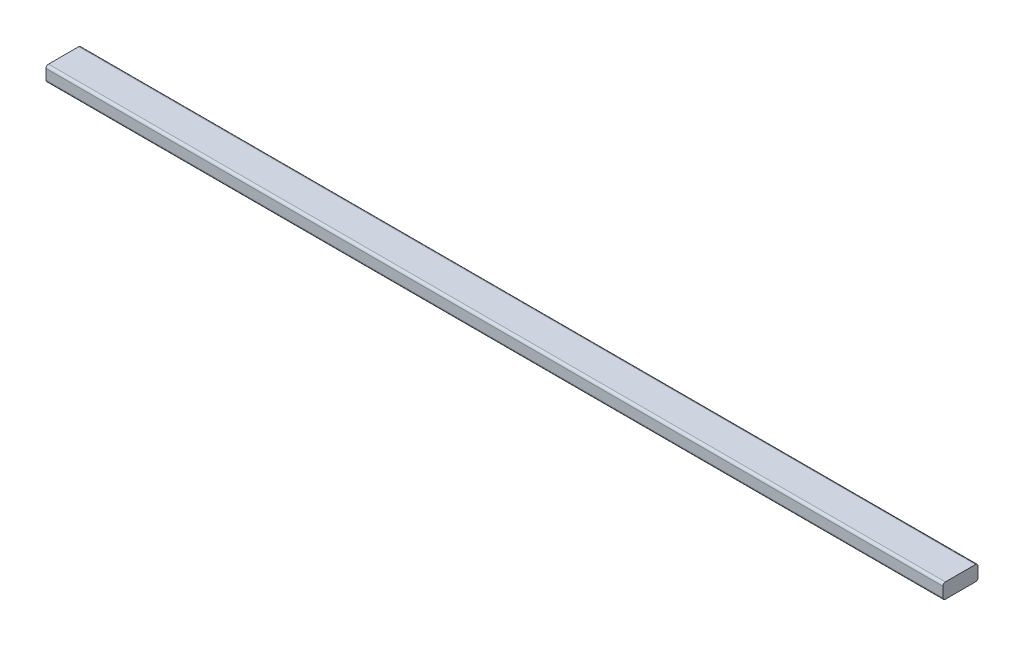
ISO-10303-21;
HEADER;
FILE_DESCRIPTION(('STEP AP214'),'2;1');
FILE_NAME('part.step','',(''),(''),'','','');
FILE_SCHEMA(('AUTOMOTIVE_DESIGN { 1 0 10303 214 1 1 1 1 }'));
ENDSEC;
DATA;
#1=APPLICATION_CONTEXT('core data for automotive mechanical design processes');
#2=APPLICATION_PROTOCOL_DEFINITION('international standard','automotive_design',2000,#1);
#3=PRODUCT_CONTEXT('',#1,'mechanical');
#4=PRODUCT('Part','Part','',(#3));
#5=PRODUCT_RELATED_PRODUCT_CATEGORY('part','',(#4));
#6=PRODUCT_DEFINITION_FORMATION('','',#4);
#7=PRODUCT_DEFINITION_CONTEXT('part definition',#1,'design');
#8=PRODUCT_DEFINITION('design','',#6,#7);
#9=PRODUCT_DEFINITION_SHAPE('','',#8);
#10=(LENGTH_UNIT() NAMED_UNIT(*) SI_UNIT(.MILLI.,.METRE.));
#11=(NAMED_UNIT(*) PLANE_ANGLE_UNIT() SI_UNIT($,.RADIAN.));
#12=(NAMED_UNIT(*) SI_UNIT($,.STERADIAN.) SOLID_ANGLE_UNIT());
#13=UNCERTAINTY_MEASURE_WITH_UNIT(LENGTH_MEASURE(1.E-05),#10,'distance_accuracy_value','');
#14=(GEOMETRIC_REPRESENTATION_CONTEXT(3) GLOBAL_UNCERTAINTY_ASSIGNED_CONTEXT((#13)) GLOBAL_UNIT_ASSIGNED_CONTEXT((#10,
#11,#12)) REPRESENTATION_CONTEXT('',''));
#15=CARTESIAN_POINT('',(0.,0.,0.));
#16=DIRECTION('',(0.,0.,1.));
#17=DIRECTION('',(1.,0.,0.));
#18=AXIS2_PLACEMENT_3D('',#15,#16,#17);
#19=CARTESIAN_POINT('',(1134.11,-12.7,38.1));
#20=DIRECTION('',(-1.,0.,0.));
#21=DIRECTION('',(0.,0.,1.));
#22=AXIS2_PLACEMENT_3D('',#19,#20,#21);
#23=CYLINDRICAL_SURFACE('',#22,6.35);
#24=CARTESIAN_POINT('',(-1134.11,-12.7,38.1));
#25=DIRECTION('',(1.,0.,0.));
#26=DIRECTION('',(0.,0.,1.));
#27=AXIS2_PLACEMENT_3D('',#24,#25,#26);
#28=CIRCLE('',#27,6.35);
#29=CARTESIAN_POINT('',(-1134.11,-12.7,44.45));
#30=VERTEX_POINT('',#29);
#31=CARTESIAN_POINT('',(-1134.11,-19.05,38.0999999999999));
#32=VERTEX_POINT('',#31);
#33=EDGE_CURVE('E130',#30,#32,#28,.T.);
#34=ORIENTED_EDGE('',*,*,#33,.T.);
#35=DIRECTION('',(-1.,0.,0.));
#36=VECTOR('',#35,1.);
#37=CARTESIAN_POINT('',(1134.11,-19.05,38.0999999999999));
#38=LINE('',#37,#36);
#39=CARTESIAN_POINT('',(1134.11,-19.05,38.0999999999999));
#40=VERTEX_POINT('',#39);
#41=EDGE_CURVE('E11',#40,#32,#38,.T.);
#42=ORIENTED_EDGE('',*,*,#41,.F.);
#43=CARTESIAN_POINT('',(1134.11,-12.7,38.1));
#44=DIRECTION('',(1.,0.,0.));
#45=DIRECTION('',(0.,0.,1.));
#46=AXIS2_PLACEMENT_3D('',#43,#44,#45);
#47=CIRCLE('',#46,6.35);
#48=CARTESIAN_POINT('',(1134.11,-12.7,44.45));
#49=VERTEX_POINT('',#48);
#50=EDGE_CURVE('E144',#49,#40,#47,.T.);
#51=ORIENTED_EDGE('',*,*,#50,.F.);
#52=DIRECTION('',(-1.,0.,0.));
#53=VECTOR('',#52,1.);
#54=CARTESIAN_POINT('',(1134.11,-12.7,44.45));
#55=LINE('',#54,#53);
#56=EDGE_CURVE('E126',#49,#30,#55,.T.);
#57=ORIENTED_EDGE('',*,*,#56,.T.);
#58=EDGE_LOOP('',(#34,#42,#51,#57));
#59=FACE_BOUND('',#58,.T.);
#60=ADVANCED_FACE('F34',(#59),#23,.T.);
#61=CARTESIAN_POINT('',(1134.11,-19.05,38.0999999999999));
#62=DIRECTION('',(0.,1.,0.));
#63=DIRECTION('',(0.,0.,1.));
#64=AXIS2_PLACEMENT_3D('',#61,#62,#63);
#65=PLANE('',#64);
#66=DIRECTION('',(0.,0.,-1.));
#67=VECTOR('',#66,1.);
#68=CARTESIAN_POINT('',(-1134.11,-19.05,38.0999999999999));
#69=LINE('',#68,#67);
#70=CARTESIAN_POINT('',(-1134.11,-19.05,-38.0999999999999));
#71=VERTEX_POINT('',#70);
#72=EDGE_CURVE('E133',#32,#71,#69,.T.);
#73=ORIENTED_EDGE('',*,*,#72,.T.);
#74=DIRECTION('',(-1.,0.,0.));
#75=VECTOR('',#74,1.);
#76=CARTESIAN_POINT('',(1134.11,-19.05,-38.0999999999999));
#77=LINE('',#76,#75);
#78=CARTESIAN_POINT('',(1134.11,-19.05,-38.0999999999999));
#79=VERTEX_POINT('',#78);
#80=EDGE_CURVE('E42',#79,#71,#77,.T.);
#81=ORIENTED_EDGE('',*,*,#80,.F.);
#82=DIRECTION('',(0.,0.,-1.));
#83=VECTOR('',#82,1.);
#84=CARTESIAN_POINT('',(1134.11,-19.05,38.0999999999999));
#85=LINE('',#84,#83);
#86=EDGE_CURVE('E93',#40,#79,#85,.T.);
#87=ORIENTED_EDGE('',*,*,#86,.F.);
#88=ORIENTED_EDGE('',*,*,#41,.T.);
#89=EDGE_LOOP('',(#73,#81,#87,#88));
#90=FACE_BOUND('',#89,.T.);
#91=ADVANCED_FACE('F179',(#90),#65,.F.);
#92=CARTESIAN_POINT('',(1134.11,-12.7,-38.1));
#93=DIRECTION('',(-1.,0.,0.));
#94=DIRECTION('',(0.,0.,1.));
#95=AXIS2_PLACEMENT_3D('',#92,#93,#94);
#96=CYLINDRICAL_SURFACE('',#95,6.35);
#97=CARTESIAN_POINT('',(-1134.11,-12.7,-38.1));
#98=DIRECTION('',(1.,0.,0.));
#99=DIRECTION('',(0.,0.,-1.));
#100=AXIS2_PLACEMENT_3D('',#97,#98,#99);
#101=CIRCLE('',#100,6.35);
#102=CARTESIAN_POINT('',(-1134.11,-12.7,-44.45));
#103=VERTEX_POINT('',#102);
#104=EDGE_CURVE('E135',#71,#103,#101,.T.);
#105=ORIENTED_EDGE('',*,*,#104,.T.);
#106=DIRECTION('',(-1.,0.,0.));
#107=VECTOR('',#106,1.);
#108=CARTESIAN_POINT('',(1134.11,-12.7,-44.45));
#109=LINE('',#108,#107);
#110=CARTESIAN_POINT('',(1134.11,-12.7,-44.45));
#111=VERTEX_POINT('',#110);
#112=EDGE_CURVE('E151',#111,#103,#109,.T.);
#113=ORIENTED_EDGE('',*,*,#112,.F.);
#114=CARTESIAN_POINT('',(1134.11,-12.7,-38.1));
#115=DIRECTION('',(1.,0.,0.));
#116=DIRECTION('',(0.,0.,-1.));
#117=AXIS2_PLACEMENT_3D('',#114,#115,#116);
#118=CIRCLE('',#117,6.35);
#119=EDGE_CURVE('E159',#79,#111,#118,.T.);
#120=ORIENTED_EDGE('',*,*,#119,.F.);
#121=ORIENTED_EDGE('',*,*,#80,.T.);
#122=EDGE_LOOP('',(#105,#113,#120,#121));
#123=FACE_BOUND('',#122,.T.);
#124=ADVANCED_FACE('F157',(#123),#96,.T.);
#125=CARTESIAN_POINT('',(1134.11,-12.7,-44.45));
#126=DIRECTION('',(0.,0.,1.));
#127=DIRECTION('',(1.,0.,0.));
#128=AXIS2_PLACEMENT_3D('',#125,#126,#127);
#129=PLANE('',#128);
#130=DIRECTION('',(0.,1.,0.));
#131=VECTOR('',#130,1.);
#132=CARTESIAN_POINT('',(-1134.11,-12.7,-44.45));
#133=LINE('',#132,#131);
#134=CARTESIAN_POINT('',(-1134.11,12.7,-44.45));
#135=VERTEX_POINT('',#134);
#136=EDGE_CURVE('E137',#103,#135,#133,.T.);
#137=ORIENTED_EDGE('',*,*,#136,.T.);
#138=DIRECTION('',(-1.,0.,0.));
#139=VECTOR('',#138,1.);
#140=CARTESIAN_POINT('',(1134.11,12.7,-44.45));
#141=LINE('',#140,#139);
#142=CARTESIAN_POINT('',(1134.11,12.7,-44.45));
#143=VERTEX_POINT('',#142);
#144=EDGE_CURVE('E148',#143,#135,#141,.T.);
#145=ORIENTED_EDGE('',*,*,#144,.F.);
#146=DIRECTION('',(0.,1.,0.));
#147=VECTOR('',#146,1.);
#148=CARTESIAN_POINT('',(1134.11,-12.7,-44.45));
#149=LINE('',#148,#147);
#150=EDGE_CURVE('E171',#111,#143,#149,.T.);
#151=ORIENTED_EDGE('',*,*,#150,.F.);
#152=ORIENTED_EDGE('',*,*,#112,.T.);
#153=EDGE_LOOP('',(#137,#145,#151,#152));
#154=FACE_BOUND('',#153,.T.);
#155=ADVANCED_FACE('F167',(#154),#129,.F.);
#156=CARTESIAN_POINT('',(1134.11,12.7,-38.1));
#157=DIRECTION('',(-1.,0.,0.));
#158=DIRECTION('',(0.,0.,1.));
#159=AXIS2_PLACEMENT_3D('',#156,#157,#158);
#160=CYLINDRICAL_SURFACE('',#159,6.35);
#161=CARTESIAN_POINT('',(-1134.11,12.7,-38.1));
#162=DIRECTION('',(1.,0.,0.));
#163=DIRECTION('',(0.,0.,1.));
#164=AXIS2_PLACEMENT_3D('',#161,#162,#163);
#165=CIRCLE('',#164,6.35);
#166=CARTESIAN_POINT('',(-1134.11,19.05,-38.0999999999999));
#167=VERTEX_POINT('',#166);
#168=EDGE_CURVE('E139',#135,#167,#165,.T.);
#169=ORIENTED_EDGE('',*,*,#168,.T.);
#170=DIRECTION('',(-1.,0.,0.));
#171=VECTOR('',#170,1.);
#172=CARTESIAN_POINT('',(1134.11,19.05,-38.0999999999999));
#173=LINE('',#172,#171);
#174=CARTESIAN_POINT('',(1134.11,19.05,-38.0999999999999));
#175=VERTEX_POINT('',#174);
#176=EDGE_CURVE('E121',#175,#167,#173,.T.);
#177=ORIENTED_EDGE('',*,*,#176,.F.);
#178=CARTESIAN_POINT('',(1134.11,12.7,-38.1));
#179=DIRECTION('',(1.,0.,0.));
#180=DIRECTION('',(0.,0.,1.));
#181=AXIS2_PLACEMENT_3D('',#178,#179,#180);
#182=CIRCLE('',#181,6.35);
#183=EDGE_CURVE('E112',#143,#175,#182,.T.);
#184=ORIENTED_EDGE('',*,*,#183,.F.);
#185=ORIENTED_EDGE('',*,*,#144,.T.);
#186=EDGE_LOOP('',(#169,#177,#184,#185));
#187=FACE_BOUND('',#186,.T.);
#188=ADVANCED_FACE('F170',(#187),#160,.T.);
#189=CARTESIAN_POINT('',(1134.11,19.05,38.0999999999999));
#190=DIRECTION('',(0.,-1.,0.));
#191=DIRECTION('',(0.,0.,-1.));
#192=AXIS2_PLACEMENT_3D('',#189,#190,#191);
#193=PLANE('',#192);
#194=DIRECTION('',(0.,0.,1.));
#195=VECTOR('',#194,1.);
#196=CARTESIAN_POINT('',(-1134.11,19.05,38.0999999999999));
#197=LINE('',#196,#195);
#198=CARTESIAN_POINT('',(-1134.11,19.05,38.0999999999999));
#199=VERTEX_POINT('',#198);
#200=EDGE_CURVE('E120',#167,#199,#197,.T.);
#201=ORIENTED_EDGE('',*,*,#200,.T.);
#202=DIRECTION('',(-1.,0.,0.));
#203=VECTOR('',#202,1.);
#204=CARTESIAN_POINT('',(1134.11,19.05,38.0999999999999));
#205=LINE('',#204,#203);
#206=CARTESIAN_POINT('',(1134.11,19.05,38.0999999999999));
#207=VERTEX_POINT('',#206);
#208=EDGE_CURVE('E117',#207,#199,#205,.T.);
#209=ORIENTED_EDGE('',*,*,#208,.F.);
#210=DIRECTION('',(0.,0.,1.));
#211=VECTOR('',#210,1.);
#212=CARTESIAN_POINT('',(1134.11,19.05,38.0999999999999));
#213=LINE('',#212,#211);
#214=EDGE_CURVE('E106',#175,#207,#213,.T.);
#215=ORIENTED_EDGE('',*,*,#214,.F.);
#216=ORIENTED_EDGE('',*,*,#176,.T.);
#217=EDGE_LOOP('',(#201,#209,#215,#216));
#218=FACE_BOUND('',#217,.T.);
#219=ADVANCED_FACE('F118',(#218),#193,.F.);
#220=CARTESIAN_POINT('',(1134.11,12.7,38.1));
#221=DIRECTION('',(-1.,0.,0.));
#222=DIRECTION('',(0.,0.,1.));
#223=AXIS2_PLACEMENT_3D('',#220,#221,#222);
#224=CYLINDRICAL_SURFACE('',#223,6.35);
#225=CARTESIAN_POINT('',(-1134.11,12.7,38.1));
#226=DIRECTION('',(1.,0.,0.));
#227=DIRECTION('',(0.,0.,1.));
#228=AXIS2_PLACEMENT_3D('',#225,#226,#227);
#229=CIRCLE('',#228,6.35);
#230=CARTESIAN_POINT('',(-1134.11,12.7,44.45));
#231=VERTEX_POINT('',#230);
#232=EDGE_CURVE('E79',#199,#231,#229,.T.);
#233=ORIENTED_EDGE('',*,*,#232,.T.);
#234=DIRECTION('',(-1.,0.,0.));
#235=VECTOR('',#234,1.);
#236=CARTESIAN_POINT('',(1134.11,12.7,44.45));
#237=LINE('',#236,#235);
#238=CARTESIAN_POINT('',(1134.11,12.7,44.45));
#239=VERTEX_POINT('',#238);
#240=EDGE_CURVE('E122',#239,#231,#237,.T.);
#241=ORIENTED_EDGE('',*,*,#240,.F.);
#242=CARTESIAN_POINT('',(1134.11,12.7,38.1));
#243=DIRECTION('',(1.,0.,0.));
#244=DIRECTION('',(0.,0.,1.));
#245=AXIS2_PLACEMENT_3D('',#242,#243,#244);
#246=CIRCLE('',#245,6.35);
#247=EDGE_CURVE('E110',#207,#239,#246,.T.);
#248=ORIENTED_EDGE('',*,*,#247,.F.);
#249=ORIENTED_EDGE('',*,*,#208,.T.);
#250=EDGE_LOOP('',(#233,#241,#248,#249));
#251=FACE_BOUND('',#250,.T.);
#252=ADVANCED_FACE('F124',(#251),#224,.T.);
#253=CARTESIAN_POINT('',(1134.11,-12.7,44.45));
#254=DIRECTION('',(0.,0.,-1.));
#255=DIRECTION('',(-1.,0.,0.));
#256=AXIS2_PLACEMENT_3D('',#253,#254,#255);
#257=PLANE('',#256);
#258=DIRECTION('',(0.,-1.,0.));
#259=VECTOR('',#258,1.);
#260=CARTESIAN_POINT('',(-1134.11,-12.7,44.45));
#261=LINE('',#260,#259);
#262=EDGE_CURVE('E85',#231,#30,#261,.T.);
#263=ORIENTED_EDGE('',*,*,#262,.T.);
#264=ORIENTED_EDGE('',*,*,#56,.F.);
#265=DIRECTION('',(0.,-1.,0.));
#266=VECTOR('',#265,1.);
#267=CARTESIAN_POINT('',(1134.11,-12.7,44.45));
#268=LINE('',#267,#266);
#269=EDGE_CURVE('E50',#239,#49,#268,.T.);
#270=ORIENTED_EDGE('',*,*,#269,.F.);
#271=ORIENTED_EDGE('',*,*,#240,.T.);
#272=EDGE_LOOP('',(#263,#264,#270,#271));
#273=FACE_BOUND('',#272,.T.);
#274=ADVANCED_FACE('F195',(#273),#257,.F.);
#275=CARTESIAN_POINT('',(1134.11,-12.7,38.1));
#276=DIRECTION('',(-1.,0.,0.));
#277=DIRECTION('',(0.,0.,1.));
#278=AXIS2_PLACEMENT_3D('',#275,#276,#277);
#279=PLANE('',#278);
#280=ORIENTED_EDGE('',*,*,#50,.T.);
#281=ORIENTED_EDGE('',*,*,#86,.T.);
#282=ORIENTED_EDGE('',*,*,#119,.T.);
#283=ORIENTED_EDGE('',*,*,#150,.T.);
#284=ORIENTED_EDGE('',*,*,#183,.T.);
#285=ORIENTED_EDGE('',*,*,#214,.T.);
#286=ORIENTED_EDGE('',*,*,#247,.T.);
#287=ORIENTED_EDGE('',*,*,#269,.T.);
#288=EDGE_LOOP('',(#280,#281,#282,#283,#284,#285,#286,#287));
#289=FACE_BOUND('',#288,.T.);
#290=ADVANCED_FACE('F108',(#289),#279,.F.);
#291=CARTESIAN_POINT('',(-1134.11,-12.7,38.1));
#292=DIRECTION('',(-1.,0.,0.));
#293=DIRECTION('',(0.,0.,1.));
#294=AXIS2_PLACEMENT_3D('',#291,#292,#293);
#295=PLANE('',#294);
#296=ORIENTED_EDGE('',*,*,#33,.F.);
#297=ORIENTED_EDGE('',*,*,#262,.F.);
#298=ORIENTED_EDGE('',*,*,#232,.F.);
#299=ORIENTED_EDGE('',*,*,#200,.F.);
#300=ORIENTED_EDGE('',*,*,#168,.F.);
#301=ORIENTED_EDGE('',*,*,#136,.F.);
#302=ORIENTED_EDGE('',*,*,#104,.F.);
#303=ORIENTED_EDGE('',*,*,#72,.F.);
#304=EDGE_LOOP('',(#296,#297,#298,#299,#300,#301,#302,#303));
#305=FACE_BOUND('',#304,.T.);
#306=ADVANCED_FACE('F163',(#305),#295,.T.);
#307=CLOSED_SHELL('',(#60,#91,#124,#155,#188,#219,#252,#274,#290,#306));
#308=MANIFOLD_SOLID_BREP('B2',#307);
#309=ADVANCED_BREP_SHAPE_REPRESENTATION('',(#18,#308),#14);
#310=SHAPE_DEFINITION_REPRESENTATION(#9,#309);
ENDSEC;
END-ISO-10303-21;
